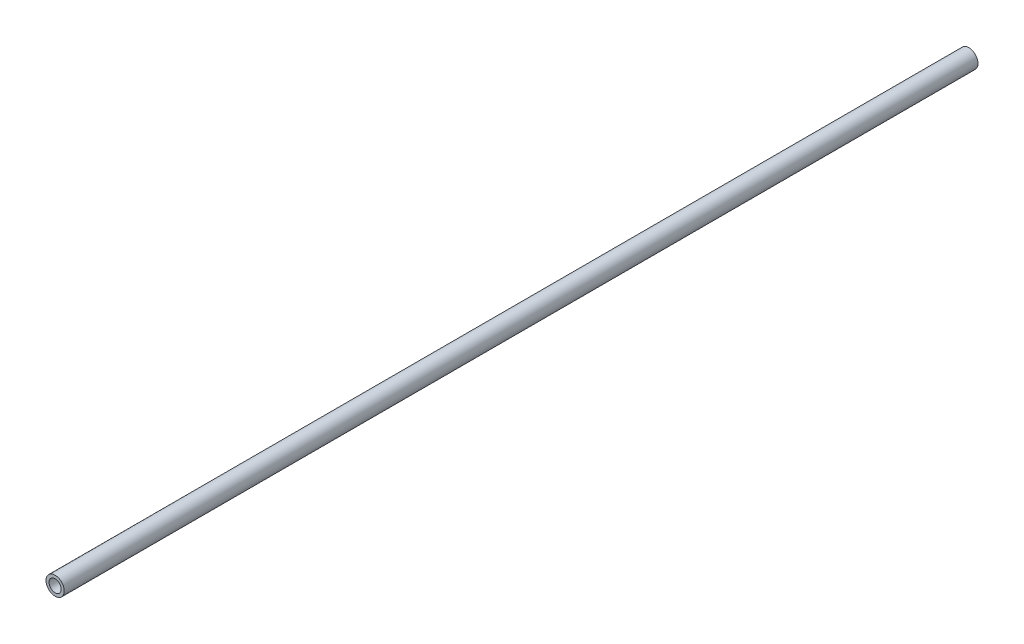
ISO-10303-21;
HEADER;
FILE_DESCRIPTION(('STEP AP214'),'2;1');
FILE_NAME('part.step','',(''),(''),'','','');
FILE_SCHEMA(('AUTOMOTIVE_DESIGN { 1 0 10303 214 1 1 1 1 }'));
ENDSEC;
DATA;
#1=APPLICATION_CONTEXT('core data for automotive mechanical design processes');
#2=APPLICATION_PROTOCOL_DEFINITION('international standard','automotive_design',2000,#1);
#3=PRODUCT_CONTEXT('',#1,'mechanical');
#4=PRODUCT('Part','Part','',(#3));
#5=PRODUCT_RELATED_PRODUCT_CATEGORY('part','',(#4));
#6=PRODUCT_DEFINITION_FORMATION('','',#4);
#7=PRODUCT_DEFINITION_CONTEXT('part definition',#1,'design');
#8=PRODUCT_DEFINITION('design','',#6,#7);
#9=PRODUCT_DEFINITION_SHAPE('','',#8);
#10=(LENGTH_UNIT() NAMED_UNIT(*) SI_UNIT(.MILLI.,.METRE.));
#11=(NAMED_UNIT(*) PLANE_ANGLE_UNIT() SI_UNIT($,.RADIAN.));
#12=(NAMED_UNIT(*) SI_UNIT($,.STERADIAN.) SOLID_ANGLE_UNIT());
#13=UNCERTAINTY_MEASURE_WITH_UNIT(LENGTH_MEASURE(1.E-05),#10,'distance_accuracy_value','');
#14=(GEOMETRIC_REPRESENTATION_CONTEXT(3) GLOBAL_UNCERTAINTY_ASSIGNED_CONTEXT((#13)) GLOBAL_UNIT_ASSIGNED_CONTEXT((#10,
#11,#12)) REPRESENTATION_CONTEXT('',''));
#15=CARTESIAN_POINT('',(0.,0.,0.));
#16=DIRECTION('',(0.,0.,1.));
#17=DIRECTION('',(1.,0.,0.));
#18=AXIS2_PLACEMENT_3D('',#15,#16,#17);
#19=CARTESIAN_POINT('',(0.,0.,762.));
#20=DIRECTION('',(0.,0.,1.));
#21=DIRECTION('',(1.,0.,0.));
#22=AXIS2_PLACEMENT_3D('',#19,#20,#21);
#23=PLANE('',#22);
#24=CARTESIAN_POINT('',(0.,0.,762.));
#25=DIRECTION('',(0.,0.,1.));
#26=DIRECTION('',(1.,0.,0.));
#27=AXIS2_PLACEMENT_3D('',#24,#25,#26);
#28=CIRCLE('',#27,7.62);
#29=CARTESIAN_POINT('',(7.62,0.,762.));
#30=VERTEX_POINT('',#29);
#31=EDGE_CURVE('E10',#30,#30,#28,.T.);
#32=ORIENTED_EDGE('',*,*,#31,.T.);
#33=EDGE_LOOP('',(#32));
#34=FACE_BOUND('',#33,.T.);
#35=CARTESIAN_POINT('',(0.,0.,762.));
#36=DIRECTION('',(0.,0.,1.));
#37=DIRECTION('',(1.,0.,0.));
#38=AXIS2_PLACEMENT_3D('',#35,#36,#37);
#39=CIRCLE('',#38,5.08);
#40=CARTESIAN_POINT('',(5.08,0.,762.));
#41=VERTEX_POINT('',#40);
#42=EDGE_CURVE('E41',#41,#41,#39,.T.);
#43=ORIENTED_EDGE('',*,*,#42,.F.);
#44=EDGE_LOOP('',(#43));
#45=FACE_BOUND('',#44,.T.);
#46=ADVANCED_FACE('F30',(#34,#45),#23,.T.);
#47=CARTESIAN_POINT('',(0.,0.,0.));
#48=DIRECTION('',(0.,0.,1.));
#49=DIRECTION('',(1.,0.,0.));
#50=AXIS2_PLACEMENT_3D('',#47,#48,#49);
#51=PLANE('',#50);
#52=CARTESIAN_POINT('',(0.,0.,0.));
#53=DIRECTION('',(0.,0.,1.));
#54=DIRECTION('',(1.,0.,0.));
#55=AXIS2_PLACEMENT_3D('',#52,#53,#54);
#56=CIRCLE('',#55,7.62);
#57=CARTESIAN_POINT('',(7.62,0.,0.));
#58=VERTEX_POINT('',#57);
#59=EDGE_CURVE('E34',#58,#58,#56,.T.);
#60=ORIENTED_EDGE('',*,*,#59,.F.);
#61=EDGE_LOOP('',(#60));
#62=FACE_BOUND('',#61,.T.);
#63=CARTESIAN_POINT('',(0.,0.,0.));
#64=DIRECTION('',(0.,0.,1.));
#65=DIRECTION('',(1.,0.,0.));
#66=AXIS2_PLACEMENT_3D('',#63,#64,#65);
#67=CIRCLE('',#66,5.08);
#68=CARTESIAN_POINT('',(5.08,0.,0.));
#69=VERTEX_POINT('',#68);
#70=EDGE_CURVE('E43',#69,#69,#67,.T.);
#71=ORIENTED_EDGE('',*,*,#70,.T.);
#72=EDGE_LOOP('',(#71));
#73=FACE_BOUND('',#72,.T.);
#74=ADVANCED_FACE('F53',(#62,#73),#51,.F.);
#75=CARTESIAN_POINT('',(0.,0.,762.));
#76=DIRECTION('',(0.,0.,-1.));
#77=DIRECTION('',(-1.,0.,0.));
#78=AXIS2_PLACEMENT_3D('',#75,#76,#77);
#79=CYLINDRICAL_SURFACE('',#78,7.62);
#80=ORIENTED_EDGE('',*,*,#31,.F.);
#81=EDGE_LOOP('',(#80));
#82=FACE_BOUND('',#81,.T.);
#83=ORIENTED_EDGE('',*,*,#59,.T.);
#84=EDGE_LOOP('',(#83));
#85=FACE_BOUND('',#84,.T.);
#86=ADVANCED_FACE('F32',(#82,#85),#79,.T.);
#87=CARTESIAN_POINT('',(0.,0.,762.));
#88=DIRECTION('',(0.,0.,-1.));
#89=DIRECTION('',(-1.,0.,0.));
#90=AXIS2_PLACEMENT_3D('',#87,#88,#89);
#91=CYLINDRICAL_SURFACE('',#90,5.08);
#92=ORIENTED_EDGE('',*,*,#42,.T.);
#93=EDGE_LOOP('',(#92));
#94=FACE_BOUND('',#93,.T.);
#95=ORIENTED_EDGE('',*,*,#70,.F.);
#96=EDGE_LOOP('',(#95));
#97=FACE_BOUND('',#96,.T.);
#98=ADVANCED_FACE('F49',(#94,#97),#91,.F.);
#99=CLOSED_SHELL('',(#46,#74,#86,#98));
#100=MANIFOLD_SOLID_BREP('B2',#99);
#101=ADVANCED_BREP_SHAPE_REPRESENTATION('',(#18,#100),#14);
#102=SHAPE_DEFINITION_REPRESENTATION(#9,#101);
ENDSEC;
END-ISO-10303-21;
